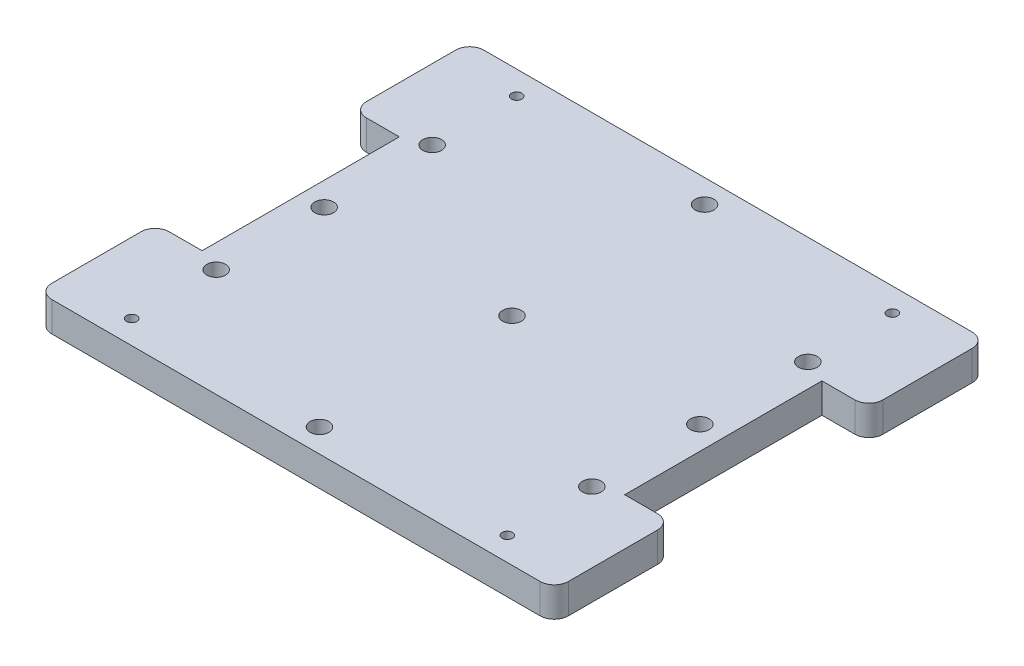
ISO-10303-21;
HEADER;
FILE_DESCRIPTION(('STEP AP214'),'2;1');
FILE_NAME('part.step','',(''),(''),'','','');
FILE_SCHEMA(('AUTOMOTIVE_DESIGN { 1 0 10303 214 1 1 1 1 }'));
ENDSEC;
DATA;
#1=APPLICATION_CONTEXT('core data for automotive mechanical design processes');
#2=APPLICATION_PROTOCOL_DEFINITION('international standard','automotive_design',2000,#1);
#3=PRODUCT_CONTEXT('',#1,'mechanical');
#4=PRODUCT('Part','Part','',(#3));
#5=PRODUCT_RELATED_PRODUCT_CATEGORY('part','',(#4));
#6=PRODUCT_DEFINITION_FORMATION('','',#4);
#7=PRODUCT_DEFINITION_CONTEXT('part definition',#1,'design');
#8=PRODUCT_DEFINITION('design','',#6,#7);
#9=PRODUCT_DEFINITION_SHAPE('','',#8);
#10=(LENGTH_UNIT() NAMED_UNIT(*) SI_UNIT(.MILLI.,.METRE.));
#11=(NAMED_UNIT(*) PLANE_ANGLE_UNIT() SI_UNIT($,.RADIAN.));
#12=(NAMED_UNIT(*) SI_UNIT($,.STERADIAN.) SOLID_ANGLE_UNIT());
#13=UNCERTAINTY_MEASURE_WITH_UNIT(LENGTH_MEASURE(1.E-05),#10,'distance_accuracy_value','');
#14=(GEOMETRIC_REPRESENTATION_CONTEXT(3) GLOBAL_UNCERTAINTY_ASSIGNED_CONTEXT((#13)) GLOBAL_UNIT_ASSIGNED_CONTEXT((#10,
#11,#12)) REPRESENTATION_CONTEXT('',''));
#15=CARTESIAN_POINT('',(0.,0.,0.));
#16=DIRECTION('',(0.,0.,1.));
#17=DIRECTION('',(1.,0.,0.));
#18=AXIS2_PLACEMENT_3D('',#15,#16,#17);
#19=CARTESIAN_POINT('',(90.,6.35,0.));
#20=DIRECTION('',(-1.,0.,0.));
#21=DIRECTION('',(0.,0.,1.));
#22=AXIS2_PLACEMENT_3D('',#19,#20,#21);
#23=PLANE('',#22);
#24=DIRECTION('',(0.,-1.,0.));
#25=VECTOR('',#24,1.);
#26=CARTESIAN_POINT('',(90.,0.,-67.));
#27=LINE('',#26,#25);
#28=CARTESIAN_POINT('',(90.,6.35000000000001,-67.));
#29=VERTEX_POINT('',#28);
#30=CARTESIAN_POINT('',(90.,0.,-67.));
#31=VERTEX_POINT('',#30);
#32=EDGE_CURVE('E221',#29,#31,#27,.T.);
#33=ORIENTED_EDGE('',*,*,#32,.F.);
#34=DIRECTION('',(0.,0.,-1.));
#35=VECTOR('',#34,1.);
#36=CARTESIAN_POINT('',(90.,6.35,0.));
#37=LINE('',#36,#35);
#38=CARTESIAN_POINT('',(90.,6.35,-25.));
#39=VERTEX_POINT('',#38);
#40=EDGE_CURVE('E274',#39,#29,#37,.T.);
#41=ORIENTED_EDGE('',*,*,#40,.F.);
#42=DIRECTION('',(0.,1.,0.));
#43=VECTOR('',#42,1.);
#44=CARTESIAN_POINT('',(90.,0.,-25.));
#45=LINE('',#44,#43);
#46=CARTESIAN_POINT('',(90.,0.,-25.));
#47=VERTEX_POINT('',#46);
#48=EDGE_CURVE('E224',#47,#39,#45,.T.);
#49=ORIENTED_EDGE('',*,*,#48,.F.);
#50=DIRECTION('',(0.,0.,-1.));
#51=VECTOR('',#50,1.);
#52=CARTESIAN_POINT('',(90.,0.,0.));
#53=LINE('',#52,#51);
#54=EDGE_CURVE('E272',#47,#31,#53,.T.);
#55=ORIENTED_EDGE('',*,*,#54,.T.);
#56=EDGE_LOOP('',(#33,#41,#49,#55));
#57=FACE_BOUND('',#56,.T.);
#58=ADVANCED_FACE('F39',(#57),#23,.F.);
#59=CARTESIAN_POINT('',(0.,6.35,0.));
#60=DIRECTION('',(0.,-1.,0.));
#61=DIRECTION('',(0.,0.,-1.));
#62=AXIS2_PLACEMENT_3D('',#59,#60,#61);
#63=PLANE('',#62);
#64=CARTESIAN_POINT('',(85.,6.35,-46.));
#65=DIRECTION('',(0.,1.,0.));
#66=DIRECTION('',(0.,0.,1.));
#67=AXIS2_PLACEMENT_3D('',#64,#65,#66);
#68=CIRCLE('',#67,2.);
#69=CARTESIAN_POINT('',(85.,6.35,-44.));
#70=VERTEX_POINT('',#69);
#71=EDGE_CURVE('E679',#70,#70,#68,.T.);
#72=ORIENTED_EDGE('',*,*,#71,.F.);
#73=EDGE_LOOP('',(#72));
#74=FACE_BOUND('',#73,.T.);
#75=CARTESIAN_POINT('',(45.,6.35,-46.));
#76=DIRECTION('',(0.,1.,0.));
#77=DIRECTION('',(0.,0.,1.));
#78=AXIS2_PLACEMENT_3D('',#75,#76,#77);
#79=CIRCLE('',#78,2.);
#80=CARTESIAN_POINT('',(45.,6.35,-44.));
#81=VERTEX_POINT('',#80);
#82=EDGE_CURVE('E676',#81,#81,#79,.T.);
#83=ORIENTED_EDGE('',*,*,#82,.F.);
#84=EDGE_LOOP('',(#83));
#85=FACE_BOUND('',#84,.T.);
#86=CARTESIAN_POINT('',(5.,6.35,-46.));
#87=DIRECTION('',(0.,1.,0.));
#88=DIRECTION('',(0.,0.,1.));
#89=AXIS2_PLACEMENT_3D('',#86,#87,#88);
#90=CIRCLE('',#89,2.);
#91=CARTESIAN_POINT('',(5.,6.35,-44.));
#92=VERTEX_POINT('',#91);
#93=EDGE_CURVE('E672',#92,#92,#90,.T.);
#94=ORIENTED_EDGE('',*,*,#93,.F.);
#95=EDGE_LOOP('',(#94));
#96=FACE_BOUND('',#95,.T.);
#97=CARTESIAN_POINT('',(45.,6.35,-5.));
#98=DIRECTION('',(0.,1.,0.));
#99=DIRECTION('',(0.,0.,1.));
#100=AXIS2_PLACEMENT_3D('',#97,#98,#99);
#101=CIRCLE('',#100,2.);
#102=CARTESIAN_POINT('',(45.,6.35,-3.));
#103=VERTEX_POINT('',#102);
#104=EDGE_CURVE('E667',#103,#103,#101,.T.);
#105=ORIENTED_EDGE('',*,*,#104,.F.);
#106=EDGE_LOOP('',(#105));
#107=FACE_BOUND('',#106,.T.);
#108=CARTESIAN_POINT('',(45.,6.35,-87.));
#109=DIRECTION('',(0.,1.,0.));
#110=DIRECTION('',(0.,0.,1.));
#111=AXIS2_PLACEMENT_3D('',#108,#109,#110);
#112=CIRCLE('',#111,2.);
#113=CARTESIAN_POINT('',(45.,6.35,-85.));
#114=VERTEX_POINT('',#113);
#115=EDGE_CURVE('E664',#114,#114,#112,.T.);
#116=ORIENTED_EDGE('',*,*,#115,.F.);
#117=EDGE_LOOP('',(#116));
#118=FACE_BOUND('',#117,.T.);
#119=CARTESIAN_POINT('',(5.,6.35,-23.));
#120=DIRECTION('',(0.,1.,0.));
#121=DIRECTION('',(0.,0.,1.));
#122=AXIS2_PLACEMENT_3D('',#119,#120,#121);
#123=CIRCLE('',#122,2.);
#124=CARTESIAN_POINT('',(5.,6.35,-21.));
#125=VERTEX_POINT('',#124);
#126=EDGE_CURVE('E652',#125,#125,#123,.T.);
#127=ORIENTED_EDGE('',*,*,#126,.F.);
#128=EDGE_LOOP('',(#127));
#129=FACE_BOUND('',#128,.T.);
#130=CARTESIAN_POINT('',(85.,6.35,-23.));
#131=DIRECTION('',(0.,1.,0.));
#132=DIRECTION('',(0.,0.,1.));
#133=AXIS2_PLACEMENT_3D('',#130,#131,#132);
#134=CIRCLE('',#133,2.);
#135=CARTESIAN_POINT('',(85.,6.35,-21.));
#136=VERTEX_POINT('',#135);
#137=EDGE_CURVE('E658',#136,#136,#134,.T.);
#138=ORIENTED_EDGE('',*,*,#137,.F.);
#139=EDGE_LOOP('',(#138));
#140=FACE_BOUND('',#139,.T.);
#141=CARTESIAN_POINT('',(5.,6.35,-69.));
#142=DIRECTION('',(0.,1.,0.));
#143=DIRECTION('',(0.,0.,1.));
#144=AXIS2_PLACEMENT_3D('',#141,#142,#143);
#145=CIRCLE('',#144,2.);
#146=CARTESIAN_POINT('',(5.,6.35,-67.));
#147=VERTEX_POINT('',#146);
#148=EDGE_CURVE('E366',#147,#147,#145,.T.);
#149=ORIENTED_EDGE('',*,*,#148,.F.);
#150=EDGE_LOOP('',(#149));
#151=FACE_BOUND('',#150,.T.);
#152=CARTESIAN_POINT('',(85.,6.35,-69.));
#153=DIRECTION('',(0.,1.,0.));
#154=DIRECTION('',(0.,0.,1.));
#155=AXIS2_PLACEMENT_3D('',#152,#153,#154);
#156=CIRCLE('',#155,2.);
#157=CARTESIAN_POINT('',(85.,6.35,-67.));
#158=VERTEX_POINT('',#157);
#159=EDGE_CURVE('E648',#158,#158,#156,.T.);
#160=ORIENTED_EDGE('',*,*,#159,.F.);
#161=EDGE_LOOP('',(#160));
#162=FACE_BOUND('',#161,.T.);
#163=DIRECTION('',(1.,0.,0.));
#164=VECTOR('',#163,1.);
#165=CARTESIAN_POINT('',(0.,6.35,-92.));
#166=LINE('',#165,#164);
#167=CARTESIAN_POINT('',(-7.,6.35,-92.));
#168=VERTEX_POINT('',#167);
#169=CARTESIAN_POINT('',(97.,6.35,-92.));
#170=VERTEX_POINT('',#169);
#171=EDGE_CURVE('E255',#168,#170,#166,.T.);
#172=ORIENTED_EDGE('',*,*,#171,.F.);
#173=CARTESIAN_POINT('',(-7.,6.35,-89.));
#174=DIRECTION('',(0.,-1.,0.));
#175=DIRECTION('',(0.,0.,-1.));
#176=AXIS2_PLACEMENT_3D('',#173,#174,#175);
#177=CIRCLE('',#176,3.);
#178=CARTESIAN_POINT('',(-10.,6.35,-89.));
#179=VERTEX_POINT('',#178);
#180=EDGE_CURVE('E327',#168,#179,#177,.F.);
#181=ORIENTED_EDGE('',*,*,#180,.T.);
#182=DIRECTION('',(0.,0.,1.));
#183=VECTOR('',#182,1.);
#184=CARTESIAN_POINT('',(-10.,6.35000000000001,-67.));
#185=LINE('',#184,#183);
#186=CARTESIAN_POINT('',(-10.,6.35000000000001,-70.));
#187=VERTEX_POINT('',#186);
#188=EDGE_CURVE('E363',#179,#187,#185,.T.);
#189=ORIENTED_EDGE('',*,*,#188,.T.);
#190=CARTESIAN_POINT('',(-7.,6.35,-70.));
#191=DIRECTION('',(0.,-1.,0.));
#192=DIRECTION('',(0.,0.,-1.));
#193=AXIS2_PLACEMENT_3D('',#190,#191,#192);
#194=CIRCLE('',#193,3.);
#195=CARTESIAN_POINT('',(-7.,6.35000000000001,-67.));
#196=VERTEX_POINT('',#195);
#197=EDGE_CURVE('E325',#187,#196,#194,.F.);
#198=ORIENTED_EDGE('',*,*,#197,.T.);
#199=DIRECTION('',(1.,0.,0.));
#200=VECTOR('',#199,1.);
#201=CARTESIAN_POINT('',(-10.,6.35000000000001,-67.));
#202=LINE('',#201,#200);
#203=CARTESIAN_POINT('',(0.,6.35,-67.));
#204=VERTEX_POINT('',#203);
#205=EDGE_CURVE('E209',#196,#204,#202,.T.);
#206=ORIENTED_EDGE('',*,*,#205,.T.);
#207=DIRECTION('',(0.,0.,1.));
#208=VECTOR('',#207,1.);
#209=CARTESIAN_POINT('',(0.,6.35,0.));
#210=LINE('',#209,#208);
#211=CARTESIAN_POINT('',(0.,6.35,-25.));
#212=VERTEX_POINT('',#211);
#213=EDGE_CURVE('E269',#204,#212,#210,.T.);
#214=ORIENTED_EDGE('',*,*,#213,.T.);
#215=DIRECTION('',(1.,0.,0.));
#216=VECTOR('',#215,1.);
#217=CARTESIAN_POINT('',(-10.,6.35,-25.));
#218=LINE('',#217,#216);
#219=CARTESIAN_POINT('',(-7.,6.35,-25.));
#220=VERTEX_POINT('',#219);
#221=EDGE_CURVE('E187',#220,#212,#218,.T.);
#222=ORIENTED_EDGE('',*,*,#221,.F.);
#223=CARTESIAN_POINT('',(-7.,6.35,-22.));
#224=DIRECTION('',(0.,-1.,0.));
#225=DIRECTION('',(0.,0.,-1.));
#226=AXIS2_PLACEMENT_3D('',#223,#224,#225);
#227=CIRCLE('',#226,3.);
#228=CARTESIAN_POINT('',(-10.,6.35,-22.));
#229=VERTEX_POINT('',#228);
#230=EDGE_CURVE('E323',#220,#229,#227,.F.);
#231=ORIENTED_EDGE('',*,*,#230,.T.);
#232=DIRECTION('',(0.,0.,1.));
#233=VECTOR('',#232,1.);
#234=CARTESIAN_POINT('',(-10.,6.35,-25.));
#235=LINE('',#234,#233);
#236=CARTESIAN_POINT('',(-10.,6.35,-3.));
#237=VERTEX_POINT('',#236);
#238=EDGE_CURVE('E204',#229,#237,#235,.T.);
#239=ORIENTED_EDGE('',*,*,#238,.T.);
#240=CARTESIAN_POINT('',(-7.,6.35,-3.));
#241=DIRECTION('',(0.,-1.,0.));
#242=DIRECTION('',(0.,0.,-1.));
#243=AXIS2_PLACEMENT_3D('',#240,#241,#242);
#244=CIRCLE('',#243,3.);
#245=CARTESIAN_POINT('',(-7.,6.35,0.));
#246=VERTEX_POINT('',#245);
#247=EDGE_CURVE('E321',#237,#246,#244,.F.);
#248=ORIENTED_EDGE('',*,*,#247,.T.);
#249=DIRECTION('',(1.,0.,0.));
#250=VECTOR('',#249,1.);
#251=CARTESIAN_POINT('',(0.,6.35,0.));
#252=LINE('',#251,#250);
#253=CARTESIAN_POINT('',(97.,6.35,0.));
#254=VERTEX_POINT('',#253);
#255=EDGE_CURVE('E271',#246,#254,#252,.T.);
#256=ORIENTED_EDGE('',*,*,#255,.T.);
#257=CARTESIAN_POINT('',(97.,6.35,-3.));
#258=DIRECTION('',(0.,-1.,0.));
#259=DIRECTION('',(0.,0.,-1.));
#260=AXIS2_PLACEMENT_3D('',#257,#258,#259);
#261=CIRCLE('',#260,3.);
#262=CARTESIAN_POINT('',(100.,6.35,-3.));
#263=VERTEX_POINT('',#262);
#264=EDGE_CURVE('E284',#254,#263,#261,.F.);
#265=ORIENTED_EDGE('',*,*,#264,.T.);
#266=DIRECTION('',(0.,0.,1.));
#267=VECTOR('',#266,1.);
#268=CARTESIAN_POINT('',(100.,6.35,-25.));
#269=LINE('',#268,#267);
#270=CARTESIAN_POINT('',(100.,6.35,-22.));
#271=VERTEX_POINT('',#270);
#272=EDGE_CURVE('E233',#271,#263,#269,.T.);
#273=ORIENTED_EDGE('',*,*,#272,.F.);
#274=CARTESIAN_POINT('',(97.,6.35,-22.));
#275=DIRECTION('',(0.,-1.,0.));
#276=DIRECTION('',(0.,0.,-1.));
#277=AXIS2_PLACEMENT_3D('',#274,#275,#276);
#278=CIRCLE('',#277,3.);
#279=CARTESIAN_POINT('',(97.,6.35,-25.));
#280=VERTEX_POINT('',#279);
#281=EDGE_CURVE('E286',#271,#280,#278,.F.);
#282=ORIENTED_EDGE('',*,*,#281,.T.);
#283=DIRECTION('',(-1.,0.,0.));
#284=VECTOR('',#283,1.);
#285=CARTESIAN_POINT('',(100.,6.35,-25.));
#286=LINE('',#285,#284);
#287=EDGE_CURVE('E236',#280,#39,#286,.T.);
#288=ORIENTED_EDGE('',*,*,#287,.T.);
#289=ORIENTED_EDGE('',*,*,#40,.T.);
#290=DIRECTION('',(-1.,0.,0.));
#291=VECTOR('',#290,1.);
#292=CARTESIAN_POINT('',(100.,6.35000000000001,-67.));
#293=LINE('',#292,#291);
#294=CARTESIAN_POINT('',(97.,6.35000000000001,-67.));
#295=VERTEX_POINT('',#294);
#296=EDGE_CURVE('E214',#295,#29,#293,.T.);
#297=ORIENTED_EDGE('',*,*,#296,.F.);
#298=CARTESIAN_POINT('',(97.,6.35,-70.));
#299=DIRECTION('',(0.,-1.,0.));
#300=DIRECTION('',(0.,0.,-1.));
#301=AXIS2_PLACEMENT_3D('',#298,#299,#300);
#302=CIRCLE('',#301,3.);
#303=CARTESIAN_POINT('',(100.,6.35000000000001,-70.));
#304=VERTEX_POINT('',#303);
#305=EDGE_CURVE('E288',#295,#304,#302,.F.);
#306=ORIENTED_EDGE('',*,*,#305,.T.);
#307=DIRECTION('',(0.,0.,1.));
#308=VECTOR('',#307,1.);
#309=CARTESIAN_POINT('',(100.,6.35000000000001,-67.));
#310=LINE('',#309,#308);
#311=CARTESIAN_POINT('',(100.,6.35,-89.));
#312=VERTEX_POINT('',#311);
#313=EDGE_CURVE('E225',#312,#304,#310,.T.);
#314=ORIENTED_EDGE('',*,*,#313,.F.);
#315=CARTESIAN_POINT('',(97.,6.35,-89.));
#316=DIRECTION('',(0.,-1.,0.));
#317=DIRECTION('',(0.,0.,-1.));
#318=AXIS2_PLACEMENT_3D('',#315,#316,#317);
#319=CIRCLE('',#318,3.);
#320=EDGE_CURVE('E290',#312,#170,#319,.F.);
#321=ORIENTED_EDGE('',*,*,#320,.T.);
#322=EDGE_LOOP('',(#172,#181,#189,#198,#206,#214,#222,#231,#239,#248,#256,#265,#273,#282,#288,
#289,#297,#306,#314,#321));
#323=FACE_BOUND('',#322,.T.);
#324=CARTESIAN_POINT('',(5.,6.35,-87.));
#325=DIRECTION('',(0.,-1.,0.));
#326=DIRECTION('',(0.,0.,-1.));
#327=AXIS2_PLACEMENT_3D('',#324,#325,#326);
#328=CIRCLE('',#327,1.1);
#329=CARTESIAN_POINT('',(5.,6.35,-88.1));
#330=VERTEX_POINT('',#329);
#331=EDGE_CURVE('E243',#330,#330,#328,.T.);
#332=ORIENTED_EDGE('',*,*,#331,.T.);
#333=EDGE_LOOP('',(#332));
#334=FACE_BOUND('',#333,.T.);
#335=CARTESIAN_POINT('',(85.,6.35,-87.));
#336=DIRECTION('',(0.,-1.,0.));
#337=DIRECTION('',(0.,0.,-1.));
#338=AXIS2_PLACEMENT_3D('',#335,#336,#337);
#339=CIRCLE('',#338,1.10000000000001);
#340=CARTESIAN_POINT('',(85.,6.35,-88.1));
#341=VERTEX_POINT('',#340);
#342=EDGE_CURVE('E249',#341,#341,#339,.T.);
#343=ORIENTED_EDGE('',*,*,#342,.T.);
#344=EDGE_LOOP('',(#343));
#345=FACE_BOUND('',#344,.T.);
#346=CARTESIAN_POINT('',(5.,6.35,-5.));
#347=DIRECTION('',(0.,1.,0.));
#348=DIRECTION('',(0.,0.,1.));
#349=AXIS2_PLACEMENT_3D('',#346,#347,#348);
#350=CIRCLE('',#349,1.1);
#351=CARTESIAN_POINT('',(5.,6.35,-3.9));
#352=VERTEX_POINT('',#351);
#353=EDGE_CURVE('E259',#352,#352,#350,.T.);
#354=ORIENTED_EDGE('',*,*,#353,.F.);
#355=EDGE_LOOP('',(#354));
#356=FACE_BOUND('',#355,.T.);
#357=CARTESIAN_POINT('',(85.,6.35,-5.));
#358=DIRECTION('',(0.,1.,0.));
#359=DIRECTION('',(0.,0.,1.));
#360=AXIS2_PLACEMENT_3D('',#357,#358,#359);
#361=CIRCLE('',#360,1.10000000000001);
#362=CARTESIAN_POINT('',(85.,6.35,-3.89999999999999));
#363=VERTEX_POINT('',#362);
#364=EDGE_CURVE('E199',#363,#363,#361,.T.);
#365=ORIENTED_EDGE('',*,*,#364,.F.);
#366=EDGE_LOOP('',(#365));
#367=FACE_BOUND('',#366,.T.);
#368=ADVANCED_FACE('F355',(#74,#85,#96,#107,#118,#129,#140,#151,#162,#323,#334,#345,#356,#367),
#63,.F.);
#369=CARTESIAN_POINT('',(0.,0.,0.));
#370=DIRECTION('',(0.,-1.,0.));
#371=DIRECTION('',(0.,0.,-1.));
#372=AXIS2_PLACEMENT_3D('',#369,#370,#371);
#373=PLANE('',#372);
#374=CARTESIAN_POINT('',(85.,0.,-46.));
#375=DIRECTION('',(0.,1.,0.));
#376=DIRECTION('',(0.,0.,1.));
#377=AXIS2_PLACEMENT_3D('',#374,#375,#376);
#378=CIRCLE('',#377,2.);
#379=CARTESIAN_POINT('',(85.,0.,-44.));
#380=VERTEX_POINT('',#379);
#381=EDGE_CURVE('E618',#380,#380,#378,.T.);
#382=ORIENTED_EDGE('',*,*,#381,.T.);
#383=EDGE_LOOP('',(#382));
#384=FACE_BOUND('',#383,.T.);
#385=CARTESIAN_POINT('',(45.,0.,-46.));
#386=DIRECTION('',(0.,1.,0.));
#387=DIRECTION('',(0.,0.,1.));
#388=AXIS2_PLACEMENT_3D('',#385,#386,#387);
#389=CIRCLE('',#388,2.);
#390=CARTESIAN_POINT('',(45.,0.,-44.));
#391=VERTEX_POINT('',#390);
#392=EDGE_CURVE('E622',#391,#391,#389,.T.);
#393=ORIENTED_EDGE('',*,*,#392,.T.);
#394=EDGE_LOOP('',(#393));
#395=FACE_BOUND('',#394,.T.);
#396=CARTESIAN_POINT('',(5.,0.,-46.));
#397=DIRECTION('',(0.,1.,0.));
#398=DIRECTION('',(0.,0.,1.));
#399=AXIS2_PLACEMENT_3D('',#396,#397,#398);
#400=CIRCLE('',#399,2.);
#401=CARTESIAN_POINT('',(5.,0.,-44.));
#402=VERTEX_POINT('',#401);
#403=EDGE_CURVE('E626',#402,#402,#400,.T.);
#404=ORIENTED_EDGE('',*,*,#403,.T.);
#405=EDGE_LOOP('',(#404));
#406=FACE_BOUND('',#405,.T.);
#407=CARTESIAN_POINT('',(45.,0.,-5.));
#408=DIRECTION('',(0.,1.,0.));
#409=DIRECTION('',(0.,0.,1.));
#410=AXIS2_PLACEMENT_3D('',#407,#408,#409);
#411=CIRCLE('',#410,2.);
#412=CARTESIAN_POINT('',(45.,0.,-3.));
#413=VERTEX_POINT('',#412);
#414=EDGE_CURVE('E630',#413,#413,#411,.T.);
#415=ORIENTED_EDGE('',*,*,#414,.T.);
#416=EDGE_LOOP('',(#415));
#417=FACE_BOUND('',#416,.T.);
#418=CARTESIAN_POINT('',(45.,0.,-87.));
#419=DIRECTION('',(0.,1.,0.));
#420=DIRECTION('',(0.,0.,1.));
#421=AXIS2_PLACEMENT_3D('',#418,#419,#420);
#422=CIRCLE('',#421,2.);
#423=CARTESIAN_POINT('',(45.,0.,-85.));
#424=VERTEX_POINT('',#423);
#425=EDGE_CURVE('E634',#424,#424,#422,.T.);
#426=ORIENTED_EDGE('',*,*,#425,.T.);
#427=EDGE_LOOP('',(#426));
#428=FACE_BOUND('',#427,.T.);
#429=CARTESIAN_POINT('',(5.,0.,-23.));
#430=DIRECTION('',(0.,1.,0.));
#431=DIRECTION('',(0.,0.,1.));
#432=AXIS2_PLACEMENT_3D('',#429,#430,#431);
#433=CIRCLE('',#432,2.);
#434=CARTESIAN_POINT('',(5.,0.,-21.));
#435=VERTEX_POINT('',#434);
#436=EDGE_CURVE('E638',#435,#435,#433,.T.);
#437=ORIENTED_EDGE('',*,*,#436,.T.);
#438=EDGE_LOOP('',(#437));
#439=FACE_BOUND('',#438,.T.);
#440=CARTESIAN_POINT('',(85.,0.,-23.));
#441=DIRECTION('',(0.,1.,0.));
#442=DIRECTION('',(0.,0.,1.));
#443=AXIS2_PLACEMENT_3D('',#440,#441,#442);
#444=CIRCLE('',#443,2.);
#445=CARTESIAN_POINT('',(85.,0.,-21.));
#446=VERTEX_POINT('',#445);
#447=EDGE_CURVE('E642',#446,#446,#444,.T.);
#448=ORIENTED_EDGE('',*,*,#447,.T.);
#449=EDGE_LOOP('',(#448));
#450=FACE_BOUND('',#449,.T.);
#451=CARTESIAN_POINT('',(5.,0.,-69.));
#452=DIRECTION('',(0.,1.,0.));
#453=DIRECTION('',(0.,0.,1.));
#454=AXIS2_PLACEMENT_3D('',#451,#452,#453);
#455=CIRCLE('',#454,2.);
#456=CARTESIAN_POINT('',(5.,0.,-67.));
#457=VERTEX_POINT('',#456);
#458=EDGE_CURVE('E361',#457,#457,#455,.T.);
#459=ORIENTED_EDGE('',*,*,#458,.T.);
#460=EDGE_LOOP('',(#459));
#461=FACE_BOUND('',#460,.T.);
#462=CARTESIAN_POINT('',(85.,0.,-69.));
#463=DIRECTION('',(0.,1.,0.));
#464=DIRECTION('',(0.,0.,1.));
#465=AXIS2_PLACEMENT_3D('',#462,#463,#464);
#466=CIRCLE('',#465,2.);
#467=CARTESIAN_POINT('',(85.,0.,-67.));
#468=VERTEX_POINT('',#467);
#469=EDGE_CURVE('E647',#468,#468,#466,.T.);
#470=ORIENTED_EDGE('',*,*,#469,.T.);
#471=EDGE_LOOP('',(#470));
#472=FACE_BOUND('',#471,.T.);
#473=DIRECTION('',(0.,0.,-1.));
#474=VECTOR('',#473,1.);
#475=CARTESIAN_POINT('',(-10.,0.,-67.));
#476=LINE('',#475,#474);
#477=CARTESIAN_POINT('',(-10.,0.,-70.));
#478=VERTEX_POINT('',#477);
#479=CARTESIAN_POINT('',(-10.,0.,-89.));
#480=VERTEX_POINT('',#479);
#481=EDGE_CURVE('E360',#478,#480,#476,.T.);
#482=ORIENTED_EDGE('',*,*,#481,.T.);
#483=CARTESIAN_POINT('',(-7.,0.,-89.));
#484=DIRECTION('',(0.,-1.,0.));
#485=DIRECTION('',(0.,0.,-1.));
#486=AXIS2_PLACEMENT_3D('',#483,#484,#485);
#487=CIRCLE('',#486,3.);
#488=CARTESIAN_POINT('',(-7.,0.,-92.));
#489=VERTEX_POINT('',#488);
#490=EDGE_CURVE('E337',#480,#489,#487,.T.);
#491=ORIENTED_EDGE('',*,*,#490,.T.);
#492=DIRECTION('',(1.,0.,0.));
#493=VECTOR('',#492,1.);
#494=CARTESIAN_POINT('',(0.,0.,-92.));
#495=LINE('',#494,#493);
#496=CARTESIAN_POINT('',(97.,0.,-92.));
#497=VERTEX_POINT('',#496);
#498=EDGE_CURVE('E252',#489,#497,#495,.T.);
#499=ORIENTED_EDGE('',*,*,#498,.T.);
#500=CARTESIAN_POINT('',(97.,0.,-89.));
#501=DIRECTION('',(0.,-1.,0.));
#502=DIRECTION('',(0.,0.,-1.));
#503=AXIS2_PLACEMENT_3D('',#500,#501,#502);
#504=CIRCLE('',#503,3.);
#505=CARTESIAN_POINT('',(100.,0.,-89.));
#506=VERTEX_POINT('',#505);
#507=EDGE_CURVE('E303',#497,#506,#504,.T.);
#508=ORIENTED_EDGE('',*,*,#507,.T.);
#509=DIRECTION('',(0.,0.,-1.));
#510=VECTOR('',#509,1.);
#511=CARTESIAN_POINT('',(100.,0.,-67.));
#512=LINE('',#511,#510);
#513=CARTESIAN_POINT('',(100.,0.,-70.));
#514=VERTEX_POINT('',#513);
#515=EDGE_CURVE('E220',#514,#506,#512,.T.);
#516=ORIENTED_EDGE('',*,*,#515,.F.);
#517=CARTESIAN_POINT('',(97.,0.,-70.));
#518=DIRECTION('',(0.,-1.,0.));
#519=DIRECTION('',(0.,0.,-1.));
#520=AXIS2_PLACEMENT_3D('',#517,#518,#519);
#521=CIRCLE('',#520,3.);
#522=CARTESIAN_POINT('',(97.,0.,-67.));
#523=VERTEX_POINT('',#522);
#524=EDGE_CURVE('E301',#514,#523,#521,.T.);
#525=ORIENTED_EDGE('',*,*,#524,.T.);
#526=DIRECTION('',(-1.,0.,0.));
#527=VECTOR('',#526,1.);
#528=CARTESIAN_POINT('',(100.,0.,-67.));
#529=LINE('',#528,#527);
#530=EDGE_CURVE('E217',#523,#31,#529,.T.);
#531=ORIENTED_EDGE('',*,*,#530,.T.);
#532=ORIENTED_EDGE('',*,*,#54,.F.);
#533=DIRECTION('',(-1.,0.,0.));
#534=VECTOR('',#533,1.);
#535=CARTESIAN_POINT('',(100.,0.,-25.));
#536=LINE('',#535,#534);
#537=CARTESIAN_POINT('',(97.,0.,-25.));
#538=VERTEX_POINT('',#537);
#539=EDGE_CURVE('E240',#538,#47,#536,.T.);
#540=ORIENTED_EDGE('',*,*,#539,.F.);
#541=CARTESIAN_POINT('',(97.,0.,-22.));
#542=DIRECTION('',(0.,-1.,0.));
#543=DIRECTION('',(0.,0.,-1.));
#544=AXIS2_PLACEMENT_3D('',#541,#542,#543);
#545=CIRCLE('',#544,3.);
#546=CARTESIAN_POINT('',(100.,0.,-22.));
#547=VERTEX_POINT('',#546);
#548=EDGE_CURVE('E299',#538,#547,#545,.T.);
#549=ORIENTED_EDGE('',*,*,#548,.T.);
#550=DIRECTION('',(0.,0.,-1.));
#551=VECTOR('',#550,1.);
#552=CARTESIAN_POINT('',(100.,0.,-25.));
#553=LINE('',#552,#551);
#554=CARTESIAN_POINT('',(100.,0.,-3.));
#555=VERTEX_POINT('',#554);
#556=EDGE_CURVE('E230',#555,#547,#553,.T.);
#557=ORIENTED_EDGE('',*,*,#556,.F.);
#558=CARTESIAN_POINT('',(97.,0.,-3.));
#559=DIRECTION('',(0.,-1.,0.));
#560=DIRECTION('',(0.,0.,-1.));
#561=AXIS2_PLACEMENT_3D('',#558,#559,#560);
#562=CIRCLE('',#561,3.);
#563=CARTESIAN_POINT('',(97.,0.,0.));
#564=VERTEX_POINT('',#563);
#565=EDGE_CURVE('E296',#555,#564,#562,.T.);
#566=ORIENTED_EDGE('',*,*,#565,.T.);
#567=DIRECTION('',(1.,0.,0.));
#568=VECTOR('',#567,1.);
#569=CARTESIAN_POINT('',(0.,0.,0.));
#570=LINE('',#569,#568);
#571=CARTESIAN_POINT('',(-7.,0.,0.));
#572=VERTEX_POINT('',#571);
#573=EDGE_CURVE('E198',#572,#564,#570,.T.);
#574=ORIENTED_EDGE('',*,*,#573,.F.);
#575=CARTESIAN_POINT('',(-7.,0.,-3.));
#576=DIRECTION('',(0.,-1.,0.));
#577=DIRECTION('',(0.,0.,-1.));
#578=AXIS2_PLACEMENT_3D('',#575,#576,#577);
#579=CIRCLE('',#578,3.);
#580=CARTESIAN_POINT('',(-10.,0.,-3.));
#581=VERTEX_POINT('',#580);
#582=EDGE_CURVE('E333',#572,#581,#579,.T.);
#583=ORIENTED_EDGE('',*,*,#582,.T.);
#584=DIRECTION('',(0.,0.,-1.));
#585=VECTOR('',#584,1.);
#586=CARTESIAN_POINT('',(-10.,0.,-25.));
#587=LINE('',#586,#585);
#588=CARTESIAN_POINT('',(-10.,0.,-22.));
#589=VERTEX_POINT('',#588);
#590=EDGE_CURVE('E188',#581,#589,#587,.T.);
#591=ORIENTED_EDGE('',*,*,#590,.T.);
#592=CARTESIAN_POINT('',(-7.,0.,-22.));
#593=DIRECTION('',(0.,-1.,0.));
#594=DIRECTION('',(0.,0.,-1.));
#595=AXIS2_PLACEMENT_3D('',#592,#593,#594);
#596=CIRCLE('',#595,3.);
#597=CARTESIAN_POINT('',(-7.,0.,-25.));
#598=VERTEX_POINT('',#597);
#599=EDGE_CURVE('E62',#589,#598,#596,.T.);
#600=ORIENTED_EDGE('',*,*,#599,.T.);
#601=DIRECTION('',(1.,0.,0.));
#602=VECTOR('',#601,1.);
#603=CARTESIAN_POINT('',(-10.,0.,-25.));
#604=LINE('',#603,#602);
#605=CARTESIAN_POINT('',(0.,0.,-25.));
#606=VERTEX_POINT('',#605);
#607=EDGE_CURVE('E176',#598,#606,#604,.T.);
#608=ORIENTED_EDGE('',*,*,#607,.T.);
#609=DIRECTION('',(0.,0.,1.));
#610=VECTOR('',#609,1.);
#611=CARTESIAN_POINT('',(0.,0.,0.));
#612=LINE('',#611,#610);
#613=CARTESIAN_POINT('',(0.,0.,-67.));
#614=VERTEX_POINT('',#613);
#615=EDGE_CURVE('E182',#614,#606,#612,.T.);
#616=ORIENTED_EDGE('',*,*,#615,.F.);
#617=DIRECTION('',(1.,0.,0.));
#618=VECTOR('',#617,1.);
#619=CARTESIAN_POINT('',(-10.,0.,-67.));
#620=LINE('',#619,#618);
#621=CARTESIAN_POINT('',(-7.,0.,-67.));
#622=VERTEX_POINT('',#621);
#623=EDGE_CURVE('E205',#622,#614,#620,.T.);
#624=ORIENTED_EDGE('',*,*,#623,.F.);
#625=CARTESIAN_POINT('',(-7.,0.,-70.));
#626=DIRECTION('',(0.,-1.,0.));
#627=DIRECTION('',(0.,0.,-1.));
#628=AXIS2_PLACEMENT_3D('',#625,#626,#627);
#629=CIRCLE('',#628,3.);
#630=EDGE_CURVE('E54',#622,#478,#629,.T.);
#631=ORIENTED_EDGE('',*,*,#630,.T.);
#632=EDGE_LOOP('',(#482,#491,#499,#508,#516,#525,#531,#532,#540,#549,#557,#566,#574,#583,#591,
#600,#608,#616,#624,#631));
#633=FACE_BOUND('',#632,.T.);
#634=CARTESIAN_POINT('',(5.,0.,-87.));
#635=DIRECTION('',(0.,-1.,0.));
#636=DIRECTION('',(0.,0.,-1.));
#637=AXIS2_PLACEMENT_3D('',#634,#635,#636);
#638=CIRCLE('',#637,1.1);
#639=CARTESIAN_POINT('',(5.,0.,-88.1));
#640=VERTEX_POINT('',#639);
#641=EDGE_CURVE('E242',#640,#640,#638,.T.);
#642=ORIENTED_EDGE('',*,*,#641,.F.);
#643=EDGE_LOOP('',(#642));
#644=FACE_BOUND('',#643,.T.);
#645=CARTESIAN_POINT('',(85.,0.,-87.));
#646=DIRECTION('',(0.,-1.,0.));
#647=DIRECTION('',(0.,0.,-1.));
#648=AXIS2_PLACEMENT_3D('',#645,#646,#647);
#649=CIRCLE('',#648,1.10000000000001);
#650=CARTESIAN_POINT('',(85.,0.,-88.1));
#651=VERTEX_POINT('',#650);
#652=EDGE_CURVE('E246',#651,#651,#649,.T.);
#653=ORIENTED_EDGE('',*,*,#652,.F.);
#654=EDGE_LOOP('',(#653));
#655=FACE_BOUND('',#654,.T.);
#656=CARTESIAN_POINT('',(85.,0.,-5.));
#657=DIRECTION('',(0.,1.,0.));
#658=DIRECTION('',(0.,0.,1.));
#659=AXIS2_PLACEMENT_3D('',#656,#657,#658);
#660=CIRCLE('',#659,1.10000000000001);
#661=CARTESIAN_POINT('',(85.,0.,-3.89999999999999));
#662=VERTEX_POINT('',#661);
#663=EDGE_CURVE('E262',#662,#662,#660,.T.);
#664=ORIENTED_EDGE('',*,*,#663,.T.);
#665=EDGE_LOOP('',(#664));
#666=FACE_BOUND('',#665,.T.);
#667=CARTESIAN_POINT('',(5.,0.,-5.));
#668=DIRECTION('',(0.,1.,0.));
#669=DIRECTION('',(0.,0.,1.));
#670=AXIS2_PLACEMENT_3D('',#667,#668,#669);
#671=CIRCLE('',#670,1.1);
#672=CARTESIAN_POINT('',(5.,0.,-3.9));
#673=VERTEX_POINT('',#672);
#674=EDGE_CURVE('E257',#673,#673,#671,.T.);
#675=ORIENTED_EDGE('',*,*,#674,.T.);
#676=EDGE_LOOP('',(#675));
#677=FACE_BOUND('',#676,.T.);
#678=ADVANCED_FACE('F179',(#384,#395,#406,#417,#428,#439,#450,#461,#472,#633,#644,#655,#666,
#677),#373,.T.);
#679=CARTESIAN_POINT('',(0.,6.35,0.));
#680=DIRECTION('',(1.,0.,0.));
#681=DIRECTION('',(0.,0.,-1.));
#682=AXIS2_PLACEMENT_3D('',#679,#680,#681);
#683=PLANE('',#682);
#684=ORIENTED_EDGE('',*,*,#213,.F.);
#685=DIRECTION('',(0.,-1.,0.));
#686=VECTOR('',#685,1.);
#687=CARTESIAN_POINT('',(0.,0.,-67.));
#688=LINE('',#687,#686);
#689=EDGE_CURVE('E197',#204,#614,#688,.T.);
#690=ORIENTED_EDGE('',*,*,#689,.T.);
#691=ORIENTED_EDGE('',*,*,#615,.T.);
#692=DIRECTION('',(0.,1.,0.));
#693=VECTOR('',#692,1.);
#694=CARTESIAN_POINT('',(0.,0.,-25.));
#695=LINE('',#694,#693);
#696=EDGE_CURVE('E195',#606,#212,#695,.T.);
#697=ORIENTED_EDGE('',*,*,#696,.T.);
#698=EDGE_LOOP('',(#684,#690,#691,#697));
#699=FACE_BOUND('',#698,.T.);
#700=ADVANCED_FACE('F194',(#699),#683,.F.);
#701=CARTESIAN_POINT('',(0.,6.35,0.));
#702=DIRECTION('',(0.,0.,-1.));
#703=DIRECTION('',(-1.,0.,0.));
#704=AXIS2_PLACEMENT_3D('',#701,#702,#703);
#705=PLANE('',#704);
#706=ORIENTED_EDGE('',*,*,#255,.F.);
#707=DIRECTION('',(0.,-1.,0.));
#708=VECTOR('',#707,1.);
#709=CARTESIAN_POINT('',(-7.,0.,0.));
#710=LINE('',#709,#708);
#711=EDGE_CURVE('E11',#246,#572,#710,.T.);
#712=ORIENTED_EDGE('',*,*,#711,.T.);
#713=ORIENTED_EDGE('',*,*,#573,.T.);
#714=DIRECTION('',(0.,-1.,0.));
#715=VECTOR('',#714,1.);
#716=CARTESIAN_POINT('',(97.,6.35,0.));
#717=LINE('',#716,#715);
#718=EDGE_CURVE('E315',#564,#254,#717,.F.);
#719=ORIENTED_EDGE('',*,*,#718,.T.);
#720=EDGE_LOOP('',(#706,#712,#713,#719));
#721=FACE_BOUND('',#720,.T.);
#722=ADVANCED_FACE('F427',(#721),#705,.F.);
#723=CARTESIAN_POINT('',(85.,6.35,-5.));
#724=DIRECTION('',(0.,-1.,0.));
#725=DIRECTION('',(0.,0.,-1.));
#726=AXIS2_PLACEMENT_3D('',#723,#724,#725);
#727=CYLINDRICAL_SURFACE('',#726,1.10000000000001);
#728=ORIENTED_EDGE('',*,*,#364,.T.);
#729=EDGE_LOOP('',(#728));
#730=FACE_BOUND('',#729,.T.);
#731=ORIENTED_EDGE('',*,*,#663,.F.);
#732=EDGE_LOOP('',(#731));
#733=FACE_BOUND('',#732,.T.);
#734=ADVANCED_FACE('F453',(#730,#733),#727,.F.);
#735=CARTESIAN_POINT('',(5.,6.35,-5.));
#736=DIRECTION('',(0.,-1.,0.));
#737=DIRECTION('',(0.,0.,-1.));
#738=AXIS2_PLACEMENT_3D('',#735,#736,#737);
#739=CYLINDRICAL_SURFACE('',#738,1.1);
#740=ORIENTED_EDGE('',*,*,#353,.T.);
#741=EDGE_LOOP('',(#740));
#742=FACE_BOUND('',#741,.T.);
#743=ORIENTED_EDGE('',*,*,#674,.F.);
#744=EDGE_LOOP('',(#743));
#745=FACE_BOUND('',#744,.T.);
#746=ADVANCED_FACE('F598',(#742,#745),#739,.F.);
#747=CARTESIAN_POINT('',(0.,6.35,-92.));
#748=DIRECTION('',(0.,0.,-1.));
#749=DIRECTION('',(-1.,0.,0.));
#750=AXIS2_PLACEMENT_3D('',#747,#748,#749);
#751=PLANE('',#750);
#752=ORIENTED_EDGE('',*,*,#498,.F.);
#753=DIRECTION('',(0.,1.,0.));
#754=VECTOR('',#753,1.);
#755=CARTESIAN_POINT('',(-7.,6.35,-92.));
#756=LINE('',#755,#754);
#757=EDGE_CURVE('E318',#489,#168,#756,.T.);
#758=ORIENTED_EDGE('',*,*,#757,.T.);
#759=ORIENTED_EDGE('',*,*,#171,.T.);
#760=DIRECTION('',(0.,1.,0.));
#761=VECTOR('',#760,1.);
#762=CARTESIAN_POINT('',(97.,0.,-92.));
#763=LINE('',#762,#761);
#764=EDGE_CURVE('E293',#170,#497,#763,.F.);
#765=ORIENTED_EDGE('',*,*,#764,.T.);
#766=EDGE_LOOP('',(#752,#758,#759,#765));
#767=FACE_BOUND('',#766,.T.);
#768=ADVANCED_FACE('F384',(#767),#751,.T.);
#769=CARTESIAN_POINT('',(85.,6.35,-87.));
#770=DIRECTION('',(0.,-1.,0.));
#771=DIRECTION('',(0.,0.,-1.));
#772=AXIS2_PLACEMENT_3D('',#769,#770,#771);
#773=CYLINDRICAL_SURFACE('',#772,1.10000000000001);
#774=ORIENTED_EDGE('',*,*,#342,.F.);
#775=EDGE_LOOP('',(#774));
#776=FACE_BOUND('',#775,.T.);
#777=ORIENTED_EDGE('',*,*,#652,.T.);
#778=EDGE_LOOP('',(#777));
#779=FACE_BOUND('',#778,.T.);
#780=ADVANCED_FACE('F591',(#776,#779),#773,.F.);
#781=CARTESIAN_POINT('',(5.,6.35,-87.));
#782=DIRECTION('',(0.,-1.,0.));
#783=DIRECTION('',(0.,0.,-1.));
#784=AXIS2_PLACEMENT_3D('',#781,#782,#783);
#785=CYLINDRICAL_SURFACE('',#784,1.1);
#786=ORIENTED_EDGE('',*,*,#331,.F.);
#787=EDGE_LOOP('',(#786));
#788=FACE_BOUND('',#787,.T.);
#789=ORIENTED_EDGE('',*,*,#641,.T.);
#790=EDGE_LOOP('',(#789));
#791=FACE_BOUND('',#790,.T.);
#792=ADVANCED_FACE('F588',(#788,#791),#785,.F.);
#793=CARTESIAN_POINT('',(100.,0.,-25.));
#794=DIRECTION('',(0.,0.,1.));
#795=DIRECTION('',(1.,0.,0.));
#796=AXIS2_PLACEMENT_3D('',#793,#794,#795);
#797=PLANE('',#796);
#798=ORIENTED_EDGE('',*,*,#287,.F.);
#799=DIRECTION('',(0.,1.,0.));
#800=VECTOR('',#799,1.);
#801=CARTESIAN_POINT('',(97.,0.,-25.));
#802=LINE('',#801,#800);
#803=EDGE_CURVE('E313',#280,#538,#802,.F.);
#804=ORIENTED_EDGE('',*,*,#803,.T.);
#805=ORIENTED_EDGE('',*,*,#539,.T.);
#806=ORIENTED_EDGE('',*,*,#48,.T.);
#807=EDGE_LOOP('',(#798,#804,#805,#806));
#808=FACE_BOUND('',#807,.T.);
#809=ADVANCED_FACE('F585',(#808),#797,.F.);
#810=CARTESIAN_POINT('',(100.,0.,0.));
#811=DIRECTION('',(1.,0.,0.));
#812=DIRECTION('',(0.,0.,-1.));
#813=AXIS2_PLACEMENT_3D('',#810,#811,#812);
#814=PLANE('',#813);
#815=ORIENTED_EDGE('',*,*,#556,.T.);
#816=DIRECTION('',(0.,1.,0.));
#817=VECTOR('',#816,1.);
#818=CARTESIAN_POINT('',(100.,6.35,-22.));
#819=LINE('',#818,#817);
#820=EDGE_CURVE('E310',#547,#271,#819,.T.);
#821=ORIENTED_EDGE('',*,*,#820,.T.);
#822=ORIENTED_EDGE('',*,*,#272,.T.);
#823=DIRECTION('',(0.,-1.,0.));
#824=VECTOR('',#823,1.);
#825=CARTESIAN_POINT('',(100.,0.,-3.));
#826=LINE('',#825,#824);
#827=EDGE_CURVE('E307',#263,#555,#826,.T.);
#828=ORIENTED_EDGE('',*,*,#827,.T.);
#829=EDGE_LOOP('',(#815,#821,#822,#828));
#830=FACE_BOUND('',#829,.T.);
#831=ADVANCED_FACE('F418',(#830),#814,.T.);
#832=CARTESIAN_POINT('',(100.,0.,-67.));
#833=DIRECTION('',(0.,0.,-1.));
#834=DIRECTION('',(-1.,0.,0.));
#835=AXIS2_PLACEMENT_3D('',#832,#833,#834);
#836=PLANE('',#835);
#837=ORIENTED_EDGE('',*,*,#530,.F.);
#838=DIRECTION('',(0.,-1.,0.));
#839=VECTOR('',#838,1.);
#840=CARTESIAN_POINT('',(97.,0.,-67.));
#841=LINE('',#840,#839);
#842=EDGE_CURVE('E305',#523,#295,#841,.F.);
#843=ORIENTED_EDGE('',*,*,#842,.T.);
#844=ORIENTED_EDGE('',*,*,#296,.T.);
#845=ORIENTED_EDGE('',*,*,#32,.T.);
#846=EDGE_LOOP('',(#837,#843,#844,#845));
#847=FACE_BOUND('',#846,.T.);
#848=ADVANCED_FACE('F402',(#847),#836,.F.);
#849=CARTESIAN_POINT('',(100.,0.,0.));
#850=DIRECTION('',(-1.,0.,0.));
#851=DIRECTION('',(0.,0.,1.));
#852=AXIS2_PLACEMENT_3D('',#849,#850,#851);
#853=PLANE('',#852);
#854=ORIENTED_EDGE('',*,*,#515,.T.);
#855=DIRECTION('',(0.,1.,0.));
#856=VECTOR('',#855,1.);
#857=CARTESIAN_POINT('',(100.,6.35,-89.));
#858=LINE('',#857,#856);
#859=EDGE_CURVE('E281',#506,#312,#858,.T.);
#860=ORIENTED_EDGE('',*,*,#859,.T.);
#861=ORIENTED_EDGE('',*,*,#313,.T.);
#862=DIRECTION('',(0.,-1.,0.));
#863=VECTOR('',#862,1.);
#864=CARTESIAN_POINT('',(100.,0.,-70.));
#865=LINE('',#864,#863);
#866=EDGE_CURVE('E275',#304,#514,#865,.T.);
#867=ORIENTED_EDGE('',*,*,#866,.T.);
#868=EDGE_LOOP('',(#854,#860,#861,#867));
#869=FACE_BOUND('',#868,.T.);
#870=ADVANCED_FACE('F392',(#869),#853,.F.);
#871=CARTESIAN_POINT('',(97.,0.,-89.));
#872=DIRECTION('',(0.,-1.,0.));
#873=DIRECTION('',(0.,0.,-1.));
#874=AXIS2_PLACEMENT_3D('',#871,#872,#873);
#875=CYLINDRICAL_SURFACE('',#874,3.);
#876=ORIENTED_EDGE('',*,*,#507,.F.);
#877=ORIENTED_EDGE('',*,*,#764,.F.);
#878=ORIENTED_EDGE('',*,*,#320,.F.);
#879=ORIENTED_EDGE('',*,*,#859,.F.);
#880=EDGE_LOOP('',(#876,#877,#878,#879));
#881=FACE_BOUND('',#880,.T.);
#882=ADVANCED_FACE('F389',(#881),#875,.T.);
#883=CARTESIAN_POINT('',(97.,0.,-70.));
#884=DIRECTION('',(0.,-1.,0.));
#885=DIRECTION('',(0.,0.,-1.));
#886=AXIS2_PLACEMENT_3D('',#883,#884,#885);
#887=CYLINDRICAL_SURFACE('',#886,3.);
#888=ORIENTED_EDGE('',*,*,#305,.F.);
#889=ORIENTED_EDGE('',*,*,#842,.F.);
#890=ORIENTED_EDGE('',*,*,#524,.F.);
#891=ORIENTED_EDGE('',*,*,#866,.F.);
#892=EDGE_LOOP('',(#888,#889,#890,#891));
#893=FACE_BOUND('',#892,.T.);
#894=ADVANCED_FACE('F397',(#893),#887,.T.);
#895=CARTESIAN_POINT('',(97.,0.,-22.));
#896=DIRECTION('',(0.,-1.,0.));
#897=DIRECTION('',(0.,0.,-1.));
#898=AXIS2_PLACEMENT_3D('',#895,#896,#897);
#899=CYLINDRICAL_SURFACE('',#898,3.);
#900=ORIENTED_EDGE('',*,*,#548,.F.);
#901=ORIENTED_EDGE('',*,*,#803,.F.);
#902=ORIENTED_EDGE('',*,*,#281,.F.);
#903=ORIENTED_EDGE('',*,*,#820,.F.);
#904=EDGE_LOOP('',(#900,#901,#902,#903));
#905=FACE_BOUND('',#904,.T.);
#906=ADVANCED_FACE('F415',(#905),#899,.T.);
#907=CARTESIAN_POINT('',(97.,0.,-3.));
#908=DIRECTION('',(0.,1.,0.));
#909=DIRECTION('',(0.,0.,1.));
#910=AXIS2_PLACEMENT_3D('',#907,#908,#909);
#911=CYLINDRICAL_SURFACE('',#910,3.);
#912=ORIENTED_EDGE('',*,*,#264,.F.);
#913=ORIENTED_EDGE('',*,*,#718,.F.);
#914=ORIENTED_EDGE('',*,*,#565,.F.);
#915=ORIENTED_EDGE('',*,*,#827,.F.);
#916=EDGE_LOOP('',(#912,#913,#914,#915));
#917=FACE_BOUND('',#916,.T.);
#918=ADVANCED_FACE('F425',(#917),#911,.T.);
#919=CARTESIAN_POINT('',(-10.,0.,-25.));
#920=DIRECTION('',(0.,0.,-1.));
#921=DIRECTION('',(-1.,0.,0.));
#922=AXIS2_PLACEMENT_3D('',#919,#920,#921);
#923=PLANE('',#922);
#924=ORIENTED_EDGE('',*,*,#607,.F.);
#925=DIRECTION('',(0.,1.,0.));
#926=VECTOR('',#925,1.);
#927=CARTESIAN_POINT('',(-7.,0.,-25.));
#928=LINE('',#927,#926);
#929=EDGE_CURVE('E341',#598,#220,#928,.T.);
#930=ORIENTED_EDGE('',*,*,#929,.T.);
#931=ORIENTED_EDGE('',*,*,#221,.T.);
#932=ORIENTED_EDGE('',*,*,#696,.F.);
#933=EDGE_LOOP('',(#924,#930,#931,#932));
#934=FACE_BOUND('',#933,.T.);
#935=ADVANCED_FACE('F201',(#934),#923,.T.);
#936=CARTESIAN_POINT('',(-10.,0.,0.));
#937=DIRECTION('',(-1.,0.,0.));
#938=DIRECTION('',(0.,0.,-1.));
#939=AXIS2_PLACEMENT_3D('',#936,#937,#938);
#940=PLANE('',#939);
#941=ORIENTED_EDGE('',*,*,#238,.F.);
#942=DIRECTION('',(0.,1.,0.));
#943=VECTOR('',#942,1.);
#944=CARTESIAN_POINT('',(-10.,0.,-22.));
#945=LINE('',#944,#943);
#946=EDGE_CURVE('E47',#229,#589,#945,.F.);
#947=ORIENTED_EDGE('',*,*,#946,.T.);
#948=ORIENTED_EDGE('',*,*,#590,.F.);
#949=DIRECTION('',(0.,-1.,0.));
#950=VECTOR('',#949,1.);
#951=CARTESIAN_POINT('',(-10.,6.35,-3.));
#952=LINE('',#951,#950);
#953=EDGE_CURVE('E343',#581,#237,#952,.F.);
#954=ORIENTED_EDGE('',*,*,#953,.T.);
#955=EDGE_LOOP('',(#941,#947,#948,#954));
#956=FACE_BOUND('',#955,.T.);
#957=ADVANCED_FACE('F348',(#956),#940,.T.);
#958=CARTESIAN_POINT('',(-10.,0.,-67.));
#959=DIRECTION('',(0.,0.,1.));
#960=DIRECTION('',(1.,0.,0.));
#961=AXIS2_PLACEMENT_3D('',#958,#959,#960);
#962=PLANE('',#961);
#963=ORIENTED_EDGE('',*,*,#205,.F.);
#964=DIRECTION('',(0.,-1.,0.));
#965=VECTOR('',#964,1.);
#966=CARTESIAN_POINT('',(-7.,0.,-67.));
#967=LINE('',#966,#965);
#968=EDGE_CURVE('E339',#196,#622,#967,.T.);
#969=ORIENTED_EDGE('',*,*,#968,.T.);
#970=ORIENTED_EDGE('',*,*,#623,.T.);
#971=ORIENTED_EDGE('',*,*,#689,.F.);
#972=EDGE_LOOP('',(#963,#969,#970,#971));
#973=FACE_BOUND('',#972,.T.);
#974=ADVANCED_FACE('F359',(#973),#962,.T.);
#975=CARTESIAN_POINT('',(-10.,0.,0.));
#976=DIRECTION('',(1.,0.,0.));
#977=DIRECTION('',(0.,0.,1.));
#978=AXIS2_PLACEMENT_3D('',#975,#976,#977);
#979=PLANE('',#978);
#980=ORIENTED_EDGE('',*,*,#188,.F.);
#981=DIRECTION('',(0.,1.,0.));
#982=VECTOR('',#981,1.);
#983=CARTESIAN_POINT('',(-10.,0.,-89.));
#984=LINE('',#983,#982);
#985=EDGE_CURVE('E331',#179,#480,#984,.F.);
#986=ORIENTED_EDGE('',*,*,#985,.T.);
#987=ORIENTED_EDGE('',*,*,#481,.F.);
#988=DIRECTION('',(0.,-1.,0.));
#989=VECTOR('',#988,1.);
#990=CARTESIAN_POINT('',(-10.,6.35000000000001,-70.));
#991=LINE('',#990,#989);
#992=EDGE_CURVE('E329',#478,#187,#991,.F.);
#993=ORIENTED_EDGE('',*,*,#992,.T.);
#994=EDGE_LOOP('',(#980,#986,#987,#993));
#995=FACE_BOUND('',#994,.T.);
#996=ADVANCED_FACE('F378',(#995),#979,.F.);
#997=CARTESIAN_POINT('',(-7.,6.35,-89.));
#998=DIRECTION('',(0.,-1.,0.));
#999=DIRECTION('',(0.,0.,-1.));
#1000=AXIS2_PLACEMENT_3D('',#997,#998,#999);
#1001=CYLINDRICAL_SURFACE('',#1000,3.);
#1002=ORIENTED_EDGE('',*,*,#490,.F.);
#1003=ORIENTED_EDGE('',*,*,#985,.F.);
#1004=ORIENTED_EDGE('',*,*,#180,.F.);
#1005=ORIENTED_EDGE('',*,*,#757,.F.);
#1006=EDGE_LOOP('',(#1002,#1003,#1004,#1005));
#1007=FACE_BOUND('',#1006,.T.);
#1008=ADVANCED_FACE('F380',(#1007),#1001,.T.);
#1009=CARTESIAN_POINT('',(-7.,0.,-70.));
#1010=DIRECTION('',(0.,1.,0.));
#1011=DIRECTION('',(0.,0.,1.));
#1012=AXIS2_PLACEMENT_3D('',#1009,#1010,#1011);
#1013=CYLINDRICAL_SURFACE('',#1012,3.);
#1014=ORIENTED_EDGE('',*,*,#197,.F.);
#1015=ORIENTED_EDGE('',*,*,#992,.F.);
#1016=ORIENTED_EDGE('',*,*,#630,.F.);
#1017=ORIENTED_EDGE('',*,*,#968,.F.);
#1018=EDGE_LOOP('',(#1014,#1015,#1016,#1017));
#1019=FACE_BOUND('',#1018,.T.);
#1020=ADVANCED_FACE('F375',(#1019),#1013,.T.);
#1021=CARTESIAN_POINT('',(-7.,0.,-22.));
#1022=DIRECTION('',(0.,1.,0.));
#1023=DIRECTION('',(0.,0.,1.));
#1024=AXIS2_PLACEMENT_3D('',#1021,#1022,#1023);
#1025=CYLINDRICAL_SURFACE('',#1024,3.);
#1026=ORIENTED_EDGE('',*,*,#599,.F.);
#1027=ORIENTED_EDGE('',*,*,#946,.F.);
#1028=ORIENTED_EDGE('',*,*,#230,.F.);
#1029=ORIENTED_EDGE('',*,*,#929,.F.);
#1030=EDGE_LOOP('',(#1026,#1027,#1028,#1029));
#1031=FACE_BOUND('',#1030,.T.);
#1032=ADVANCED_FACE('F352',(#1031),#1025,.T.);
#1033=CARTESIAN_POINT('',(-7.,6.35,-3.));
#1034=DIRECTION('',(0.,1.,0.));
#1035=DIRECTION('',(0.,0.,1.));
#1036=AXIS2_PLACEMENT_3D('',#1033,#1034,#1035);
#1037=CYLINDRICAL_SURFACE('',#1036,3.);
#1038=ORIENTED_EDGE('',*,*,#247,.F.);
#1039=ORIENTED_EDGE('',*,*,#953,.F.);
#1040=ORIENTED_EDGE('',*,*,#582,.F.);
#1041=ORIENTED_EDGE('',*,*,#711,.F.);
#1042=EDGE_LOOP('',(#1038,#1039,#1040,#1041));
#1043=FACE_BOUND('',#1042,.T.);
#1044=ADVANCED_FACE('F41',(#1043),#1037,.T.);
#1045=CARTESIAN_POINT('',(85.,0.,-69.));
#1046=DIRECTION('',(0.,1.,0.));
#1047=DIRECTION('',(0.,0.,1.));
#1048=AXIS2_PLACEMENT_3D('',#1045,#1046,#1047);
#1049=CYLINDRICAL_SURFACE('',#1048,2.);
#1050=ORIENTED_EDGE('',*,*,#469,.F.);
#1051=EDGE_LOOP('',(#1050));
#1052=FACE_BOUND('',#1051,.T.);
#1053=ORIENTED_EDGE('',*,*,#159,.T.);
#1054=EDGE_LOOP('',(#1053));
#1055=FACE_BOUND('',#1054,.T.);
#1056=ADVANCED_FACE('F432',(#1052,#1055),#1049,.F.);
#1057=CARTESIAN_POINT('',(5.,0.,-69.));
#1058=DIRECTION('',(0.,1.,0.));
#1059=DIRECTION('',(0.,0.,1.));
#1060=AXIS2_PLACEMENT_3D('',#1057,#1058,#1059);
#1061=CYLINDRICAL_SURFACE('',#1060,2.);
#1062=ORIENTED_EDGE('',*,*,#458,.F.);
#1063=EDGE_LOOP('',(#1062));
#1064=FACE_BOUND('',#1063,.T.);
#1065=ORIENTED_EDGE('',*,*,#148,.T.);
#1066=EDGE_LOOP('',(#1065));
#1067=FACE_BOUND('',#1066,.T.);
#1068=ADVANCED_FACE('F437',(#1064,#1067),#1061,.F.);
#1069=CARTESIAN_POINT('',(85.,0.,-23.));
#1070=DIRECTION('',(0.,1.,0.));
#1071=DIRECTION('',(0.,0.,1.));
#1072=AXIS2_PLACEMENT_3D('',#1069,#1070,#1071);
#1073=CYLINDRICAL_SURFACE('',#1072,2.);
#1074=ORIENTED_EDGE('',*,*,#447,.F.);
#1075=EDGE_LOOP('',(#1074));
#1076=FACE_BOUND('',#1075,.T.);
#1077=ORIENTED_EDGE('',*,*,#137,.T.);
#1078=EDGE_LOOP('',(#1077));
#1079=FACE_BOUND('',#1078,.T.);
#1080=ADVANCED_FACE('F495',(#1076,#1079),#1073,.F.);
#1081=CARTESIAN_POINT('',(5.,0.,-23.));
#1082=DIRECTION('',(0.,1.,0.));
#1083=DIRECTION('',(0.,0.,1.));
#1084=AXIS2_PLACEMENT_3D('',#1081,#1082,#1083);
#1085=CYLINDRICAL_SURFACE('',#1084,2.);
#1086=ORIENTED_EDGE('',*,*,#436,.F.);
#1087=EDGE_LOOP('',(#1086));
#1088=FACE_BOUND('',#1087,.T.);
#1089=ORIENTED_EDGE('',*,*,#126,.T.);
#1090=EDGE_LOOP('',(#1089));
#1091=FACE_BOUND('',#1090,.T.);
#1092=ADVANCED_FACE('F505',(#1088,#1091),#1085,.F.);
#1093=CARTESIAN_POINT('',(45.,0.,-87.));
#1094=DIRECTION('',(0.,1.,0.));
#1095=DIRECTION('',(0.,0.,1.));
#1096=AXIS2_PLACEMENT_3D('',#1093,#1094,#1095);
#1097=CYLINDRICAL_SURFACE('',#1096,2.);
#1098=ORIENTED_EDGE('',*,*,#425,.F.);
#1099=EDGE_LOOP('',(#1098));
#1100=FACE_BOUND('',#1099,.T.);
#1101=ORIENTED_EDGE('',*,*,#115,.T.);
#1102=EDGE_LOOP('',(#1101));
#1103=FACE_BOUND('',#1102,.T.);
#1104=ADVANCED_FACE('F515',(#1100,#1103),#1097,.F.);
#1105=CARTESIAN_POINT('',(45.,0.,-5.));
#1106=DIRECTION('',(0.,1.,0.));
#1107=DIRECTION('',(0.,0.,1.));
#1108=AXIS2_PLACEMENT_3D('',#1105,#1106,#1107);
#1109=CYLINDRICAL_SURFACE('',#1108,2.);
#1110=ORIENTED_EDGE('',*,*,#414,.F.);
#1111=EDGE_LOOP('',(#1110));
#1112=FACE_BOUND('',#1111,.T.);
#1113=ORIENTED_EDGE('',*,*,#104,.T.);
#1114=EDGE_LOOP('',(#1113));
#1115=FACE_BOUND('',#1114,.T.);
#1116=ADVANCED_FACE('F525',(#1112,#1115),#1109,.F.);
#1117=CARTESIAN_POINT('',(5.,0.,-46.));
#1118=DIRECTION('',(0.,1.,0.));
#1119=DIRECTION('',(0.,0.,1.));
#1120=AXIS2_PLACEMENT_3D('',#1117,#1118,#1119);
#1121=CYLINDRICAL_SURFACE('',#1120,2.);
#1122=ORIENTED_EDGE('',*,*,#403,.F.);
#1123=EDGE_LOOP('',(#1122));
#1124=FACE_BOUND('',#1123,.T.);
#1125=ORIENTED_EDGE('',*,*,#93,.T.);
#1126=EDGE_LOOP('',(#1125));
#1127=FACE_BOUND('',#1126,.T.);
#1128=ADVANCED_FACE('F535',(#1124,#1127),#1121,.F.);
#1129=CARTESIAN_POINT('',(45.,0.,-46.));
#1130=DIRECTION('',(0.,1.,0.));
#1131=DIRECTION('',(0.,0.,1.));
#1132=AXIS2_PLACEMENT_3D('',#1129,#1130,#1131);
#1133=CYLINDRICAL_SURFACE('',#1132,2.);
#1134=ORIENTED_EDGE('',*,*,#392,.F.);
#1135=EDGE_LOOP('',(#1134));
#1136=FACE_BOUND('',#1135,.T.);
#1137=ORIENTED_EDGE('',*,*,#82,.T.);
#1138=EDGE_LOOP('',(#1137));
#1139=FACE_BOUND('',#1138,.T.);
#1140=ADVANCED_FACE('F545',(#1136,#1139),#1133,.F.);
#1141=CARTESIAN_POINT('',(85.,0.,-46.));
#1142=DIRECTION('',(0.,1.,0.));
#1143=DIRECTION('',(0.,0.,1.));
#1144=AXIS2_PLACEMENT_3D('',#1141,#1142,#1143);
#1145=CYLINDRICAL_SURFACE('',#1144,2.);
#1146=ORIENTED_EDGE('',*,*,#381,.F.);
#1147=EDGE_LOOP('',(#1146));
#1148=FACE_BOUND('',#1147,.T.);
#1149=ORIENTED_EDGE('',*,*,#71,.T.);
#1150=EDGE_LOOP('',(#1149));
#1151=FACE_BOUND('',#1150,.T.);
#1152=ADVANCED_FACE('F556',(#1148,#1151),#1145,.F.);
#1153=CLOSED_SHELL('',(#58,#368,#678,#700,#722,#734,#746,#768,#780,#792,#809,#831,#848,#870,
#882,#894,#906,#918,#935,#957,#974,#996,#1008,#1020,#1032,#1044,#1056,#1068,#1080,#1092,#1104,
#1116,#1128,#1140,#1152));
#1154=MANIFOLD_SOLID_BREP('B2',#1153);
#1155=ADVANCED_BREP_SHAPE_REPRESENTATION('',(#18,#1154),#14);
#1156=SHAPE_DEFINITION_REPRESENTATION(#9,#1155);
ENDSEC;
END-ISO-10303-21;
